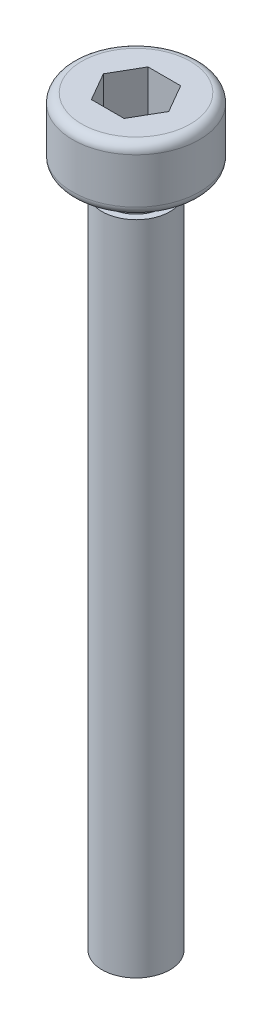
ISO-10303-21;
HEADER;
FILE_DESCRIPTION(('STEP AP214'),'2;1');
FILE_NAME('part.step','',(''),(''),'','','');
FILE_SCHEMA(('AUTOMOTIVE_DESIGN { 1 0 10303 214 1 1 1 1 }'));
ENDSEC;
DATA;
#1=APPLICATION_CONTEXT('core data for automotive mechanical design processes');
#2=APPLICATION_PROTOCOL_DEFINITION('international standard','automotive_design',2000,#1);
#3=PRODUCT_CONTEXT('',#1,'mechanical');
#4=PRODUCT('Part','Part','',(#3));
#5=PRODUCT_RELATED_PRODUCT_CATEGORY('part','',(#4));
#6=PRODUCT_DEFINITION_FORMATION('','',#4);
#7=PRODUCT_DEFINITION_CONTEXT('part definition',#1,'design');
#8=PRODUCT_DEFINITION('design','',#6,#7);
#9=PRODUCT_DEFINITION_SHAPE('','',#8);
#10=(LENGTH_UNIT() NAMED_UNIT(*) SI_UNIT(.MILLI.,.METRE.));
#11=(NAMED_UNIT(*) PLANE_ANGLE_UNIT() SI_UNIT($,.RADIAN.));
#12=(NAMED_UNIT(*) SI_UNIT($,.STERADIAN.) SOLID_ANGLE_UNIT());
#13=UNCERTAINTY_MEASURE_WITH_UNIT(LENGTH_MEASURE(1.E-05),#10,'distance_accuracy_value','');
#14=(GEOMETRIC_REPRESENTATION_CONTEXT(3) GLOBAL_UNCERTAINTY_ASSIGNED_CONTEXT((#13)) GLOBAL_UNIT_ASSIGNED_CONTEXT((#10,
#11,#12)) REPRESENTATION_CONTEXT('',''));
#15=CARTESIAN_POINT('',(0.,0.,0.));
#16=DIRECTION('',(0.,0.,1.));
#17=DIRECTION('',(1.,0.,0.));
#18=AXIS2_PLACEMENT_3D('',#15,#16,#17);
#19=CARTESIAN_POINT('',(0.,32.8,0.));
#20=DIRECTION('',(0.,-1.,0.));
#21=DIRECTION('',(0.,0.,-1.));
#22=AXIS2_PLACEMENT_3D('',#19,#20,#21);
#23=PLANE('',#22);
#24=DIRECTION('',(-0.5,0.,0.866025403784439));
#25=VECTOR('',#24,1.);
#26=CARTESIAN_POINT('',(-0.721687836487032,32.8,-1.25));
#27=LINE('',#26,#25);
#28=CARTESIAN_POINT('',(-0.721687836487032,32.8,-1.25));
#29=VERTEX_POINT('',#28);
#30=CARTESIAN_POINT('',(-1.44337567297406,32.8,0.));
#31=VERTEX_POINT('',#30);
#32=EDGE_CURVE('E124',#29,#31,#27,.T.);
#33=ORIENTED_EDGE('',*,*,#32,.F.);
#34=DIRECTION('',(-1.,0.,0.));
#35=VECTOR('',#34,1.);
#36=CARTESIAN_POINT('',(0.721687836487033,32.8,-1.25));
#37=LINE('',#36,#35);
#38=CARTESIAN_POINT('',(0.721687836487033,32.8,-1.25));
#39=VERTEX_POINT('',#38);
#40=EDGE_CURVE('E50',#39,#29,#37,.T.);
#41=ORIENTED_EDGE('',*,*,#40,.F.);
#42=DIRECTION('',(-0.5,0.,-0.866025403784439));
#43=VECTOR('',#42,1.);
#44=CARTESIAN_POINT('',(1.44337567297406,32.8,0.));
#45=LINE('',#44,#43);
#46=CARTESIAN_POINT('',(1.44337567297406,32.8,0.));
#47=VERTEX_POINT('',#46);
#48=EDGE_CURVE('E133',#47,#39,#45,.T.);
#49=ORIENTED_EDGE('',*,*,#48,.F.);
#50=DIRECTION('',(0.5,0.,-0.866025403784439));
#51=VECTOR('',#50,1.);
#52=CARTESIAN_POINT('',(0.721687836487032,32.8,1.25));
#53=LINE('',#52,#51);
#54=CARTESIAN_POINT('',(0.721687836487032,32.8,1.25));
#55=VERTEX_POINT('',#54);
#56=EDGE_CURVE('E131',#55,#47,#53,.T.);
#57=ORIENTED_EDGE('',*,*,#56,.F.);
#58=DIRECTION('',(1.,0.,0.));
#59=VECTOR('',#58,1.);
#60=CARTESIAN_POINT('',(-0.721687836487033,32.8,1.25));
#61=LINE('',#60,#59);
#62=CARTESIAN_POINT('',(-0.721687836487033,32.8,1.25));
#63=VERTEX_POINT('',#62);
#64=EDGE_CURVE('E98',#63,#55,#61,.T.);
#65=ORIENTED_EDGE('',*,*,#64,.F.);
#66=DIRECTION('',(0.5,0.,0.866025403784439));
#67=VECTOR('',#66,1.);
#68=CARTESIAN_POINT('',(-1.44337567297406,32.8,0.));
#69=LINE('',#68,#67);
#70=EDGE_CURVE('E127',#31,#63,#69,.T.);
#71=ORIENTED_EDGE('',*,*,#70,.F.);
#72=EDGE_LOOP('',(#33,#41,#49,#57,#65,#71));
#73=FACE_BOUND('',#72,.T.);
#74=CARTESIAN_POINT('',(0.,32.8,0.));
#75=DIRECTION('',(0.,-1.,0.));
#76=DIRECTION('',(0.,0.,-1.));
#77=AXIS2_PLACEMENT_3D('',#74,#75,#76);
#78=CIRCLE('',#77,2.4);
#79=CARTESIAN_POINT('',(0.,32.8,-2.4));
#80=VERTEX_POINT('',#79);
#81=EDGE_CURVE('E11',#80,#80,#78,.T.);
#82=ORIENTED_EDGE('',*,*,#81,.F.);
#83=EDGE_LOOP('',(#82));
#84=FACE_BOUND('',#83,.T.);
#85=ADVANCED_FACE('F36',(#73,#84),#23,.F.);
#86=CARTESIAN_POINT('',(0.,32.4,0.));
#87=DIRECTION('',(0.,-1.,0.));
#88=DIRECTION('',(0.,0.,-1.));
#89=AXIS2_PLACEMENT_3D('',#86,#87,#88);
#90=TOROIDAL_SURFACE('',#89,2.4,0.399999999999995);
#91=CARTESIAN_POINT('',(0.,32.4,0.));
#92=DIRECTION('',(0.,-1.,0.));
#93=DIRECTION('',(0.,0.,-1.));
#94=AXIS2_PLACEMENT_3D('',#91,#92,#93);
#95=CIRCLE('',#94,2.8);
#96=CARTESIAN_POINT('',(0.,32.4,-2.8));
#97=VERTEX_POINT('',#96);
#98=EDGE_CURVE('E43',#97,#97,#95,.T.);
#99=ORIENTED_EDGE('',*,*,#98,.F.);
#100=EDGE_LOOP('',(#99));
#101=FACE_BOUND('',#100,.T.);
#102=ORIENTED_EDGE('',*,*,#81,.T.);
#103=EDGE_LOOP('',(#102));
#104=FACE_BOUND('',#103,.T.);
#105=ADVANCED_FACE('F164',(#101,#104),#90,.T.);
#106=CARTESIAN_POINT('',(0.,0.,0.));
#107=DIRECTION('',(0.,-1.,0.));
#108=DIRECTION('',(0.,0.,-1.));
#109=AXIS2_PLACEMENT_3D('',#106,#107,#108);
#110=CYLINDRICAL_SURFACE('',#109,2.8);
#111=CARTESIAN_POINT('',(0.,30.4,0.));
#112=DIRECTION('',(0.,-1.,0.));
#113=DIRECTION('',(0.,0.,-1.));
#114=AXIS2_PLACEMENT_3D('',#111,#112,#113);
#115=CIRCLE('',#114,2.8);
#116=CARTESIAN_POINT('',(0.,30.4,-2.8));
#117=VERTEX_POINT('',#116);
#118=EDGE_CURVE('E157',#117,#117,#115,.T.);
#119=ORIENTED_EDGE('',*,*,#118,.F.);
#120=EDGE_LOOP('',(#119));
#121=FACE_BOUND('',#120,.T.);
#122=ORIENTED_EDGE('',*,*,#98,.T.);
#123=EDGE_LOOP('',(#122));
#124=FACE_BOUND('',#123,.T.);
#125=ADVANCED_FACE('F162',(#121,#124),#110,.T.);
#126=CARTESIAN_POINT('',(0.,30.4,0.));
#127=DIRECTION('',(0.,-1.,0.));
#128=DIRECTION('',(0.,0.,-1.));
#129=AXIS2_PLACEMENT_3D('',#126,#127,#128);
#130=TOROIDAL_SURFACE('',#129,2.4,0.4);
#131=CARTESIAN_POINT('',(0.,30.,0.));
#132=DIRECTION('',(0.,-1.,0.));
#133=DIRECTION('',(0.,0.,-1.));
#134=AXIS2_PLACEMENT_3D('',#131,#132,#133);
#135=CIRCLE('',#134,2.4);
#136=CARTESIAN_POINT('',(0.,30.,-2.4));
#137=VERTEX_POINT('',#136);
#138=EDGE_CURVE('E154',#137,#137,#135,.T.);
#139=ORIENTED_EDGE('',*,*,#138,.F.);
#140=EDGE_LOOP('',(#139));
#141=FACE_BOUND('',#140,.T.);
#142=ORIENTED_EDGE('',*,*,#118,.T.);
#143=EDGE_LOOP('',(#142));
#144=FACE_BOUND('',#143,.T.);
#145=ADVANCED_FACE('F209',(#141,#144),#130,.T.);
#146=CARTESIAN_POINT('',(-2.4,30.,0.));
#147=DIRECTION('',(0.,1.,0.));
#148=DIRECTION('',(0.,0.,1.));
#149=AXIS2_PLACEMENT_3D('',#146,#147,#148);
#150=PLANE('',#149);
#151=CARTESIAN_POINT('',(0.,30.,0.));
#152=DIRECTION('',(0.,-1.,0.));
#153=DIRECTION('',(0.,0.,-1.));
#154=AXIS2_PLACEMENT_3D('',#151,#152,#153);
#155=CIRCLE('',#154,1.20000000000001);
#156=CARTESIAN_POINT('',(0.,30.,-1.20000000000001));
#157=VERTEX_POINT('',#156);
#158=EDGE_CURVE('E151',#157,#157,#155,.T.);
#159=ORIENTED_EDGE('',*,*,#158,.F.);
#160=EDGE_LOOP('',(#159));
#161=FACE_BOUND('',#160,.T.);
#162=ORIENTED_EDGE('',*,*,#138,.T.);
#163=EDGE_LOOP('',(#162));
#164=FACE_BOUND('',#163,.T.);
#165=ADVANCED_FACE('F205',(#161,#164),#150,.F.);
#166=CARTESIAN_POINT('',(0.,0.,0.));
#167=DIRECTION('',(0.,-1.,0.));
#168=DIRECTION('',(0.,0.,-1.));
#169=AXIS2_PLACEMENT_3D('',#166,#167,#168);
#170=CYLINDRICAL_SURFACE('',#169,1.20000000000001);
#171=CARTESIAN_POINT('',(0.,29.,0.));
#172=DIRECTION('',(0.,-1.,0.));
#173=DIRECTION('',(0.,0.,-1.));
#174=AXIS2_PLACEMENT_3D('',#171,#172,#173);
#175=CIRCLE('',#174,1.20000000000001);
#176=CARTESIAN_POINT('',(0.,29.,-1.20000000000001));
#177=VERTEX_POINT('',#176);
#178=EDGE_CURVE('E148',#177,#177,#175,.T.);
#179=ORIENTED_EDGE('',*,*,#178,.F.);
#180=EDGE_LOOP('',(#179));
#181=FACE_BOUND('',#180,.T.);
#182=ORIENTED_EDGE('',*,*,#158,.T.);
#183=EDGE_LOOP('',(#182));
#184=FACE_BOUND('',#183,.T.);
#185=ADVANCED_FACE('F201',(#181,#184),#170,.T.);
#186=CARTESIAN_POINT('',(-1.20000000000001,29.,0.));
#187=DIRECTION('',(0.,-1.,0.));
#188=DIRECTION('',(0.,0.,-1.));
#189=AXIS2_PLACEMENT_3D('',#186,#187,#188);
#190=PLANE('',#189);
#191=CARTESIAN_POINT('',(0.,29.,0.));
#192=DIRECTION('',(0.,-1.,0.));
#193=DIRECTION('',(0.,0.,-1.));
#194=AXIS2_PLACEMENT_3D('',#191,#192,#193);
#195=CIRCLE('',#194,1.5);
#196=CARTESIAN_POINT('',(0.,29.,-1.5));
#197=VERTEX_POINT('',#196);
#198=EDGE_CURVE('E145',#197,#197,#195,.T.);
#199=ORIENTED_EDGE('',*,*,#198,.F.);
#200=EDGE_LOOP('',(#199));
#201=FACE_BOUND('',#200,.T.);
#202=ORIENTED_EDGE('',*,*,#178,.T.);
#203=EDGE_LOOP('',(#202));
#204=FACE_BOUND('',#203,.T.);
#205=ADVANCED_FACE('F197',(#201,#204),#190,.F.);
#206=CARTESIAN_POINT('',(0.,0.,0.));
#207=DIRECTION('',(0.,-1.,0.));
#208=DIRECTION('',(0.,0.,-1.));
#209=AXIS2_PLACEMENT_3D('',#206,#207,#208);
#210=CYLINDRICAL_SURFACE('',#209,1.5);
#211=CARTESIAN_POINT('',(0.,0.,0.));
#212=DIRECTION('',(0.,-1.,0.));
#213=DIRECTION('',(0.,0.,-1.));
#214=AXIS2_PLACEMENT_3D('',#211,#212,#213);
#215=CIRCLE('',#214,1.5);
#216=CARTESIAN_POINT('',(0.,0.,-1.5));
#217=VERTEX_POINT('',#216);
#218=EDGE_CURVE('E137',#217,#217,#215,.T.);
#219=ORIENTED_EDGE('',*,*,#218,.F.);
#220=EDGE_LOOP('',(#219));
#221=FACE_BOUND('',#220,.T.);
#222=ORIENTED_EDGE('',*,*,#198,.T.);
#223=EDGE_LOOP('',(#222));
#224=FACE_BOUND('',#223,.T.);
#225=ADVANCED_FACE('F189',(#221,#224),#210,.T.);
#226=CARTESIAN_POINT('',(-1.5,0.,0.));
#227=DIRECTION('',(0.,1.,0.));
#228=DIRECTION('',(0.,0.,1.));
#229=AXIS2_PLACEMENT_3D('',#226,#227,#228);
#230=PLANE('',#229);
#231=ORIENTED_EDGE('',*,*,#218,.T.);
#232=EDGE_LOOP('',(#231));
#233=FACE_BOUND('',#232,.T.);
#234=ADVANCED_FACE('F182',(#233),#230,.F.);
#235=CARTESIAN_POINT('',(0.721687836487033,30.8,-1.25));
#236=DIRECTION('',(0.,0.,-1.));
#237=DIRECTION('',(-1.,0.,0.));
#238=AXIS2_PLACEMENT_3D('',#235,#236,#237);
#239=PLANE('',#238);
#240=ORIENTED_EDGE('',*,*,#40,.T.);
#241=DIRECTION('',(0.,1.,0.));
#242=VECTOR('',#241,1.);
#243=CARTESIAN_POINT('',(-0.721687836487032,30.8,-1.25));
#244=LINE('',#243,#242);
#245=CARTESIAN_POINT('',(-0.721687836487032,30.8,-1.25));
#246=VERTEX_POINT('',#245);
#247=EDGE_CURVE('E80',#246,#29,#244,.T.);
#248=ORIENTED_EDGE('',*,*,#247,.F.);
#249=DIRECTION('',(-1.,0.,0.));
#250=VECTOR('',#249,1.);
#251=CARTESIAN_POINT('',(0.721687836487033,30.8,-1.25));
#252=LINE('',#251,#250);
#253=CARTESIAN_POINT('',(0.721687836487033,30.8,-1.25));
#254=VERTEX_POINT('',#253);
#255=EDGE_CURVE('E135',#254,#246,#252,.T.);
#256=ORIENTED_EDGE('',*,*,#255,.F.);
#257=DIRECTION('',(0.,1.,0.));
#258=VECTOR('',#257,1.);
#259=CARTESIAN_POINT('',(0.721687836487033,30.8,-1.25));
#260=LINE('',#259,#258);
#261=EDGE_CURVE('E58',#254,#39,#260,.T.);
#262=ORIENTED_EDGE('',*,*,#261,.T.);
#263=EDGE_LOOP('',(#240,#248,#256,#262));
#264=FACE_BOUND('',#263,.T.);
#265=ADVANCED_FACE('F179',(#264),#239,.F.);
#266=CARTESIAN_POINT('',(1.44337567297406,30.8,0.));
#267=DIRECTION('',(0.866025403784439,0.,-0.5));
#268=DIRECTION('',(-0.5,0.,-0.866025403784439));
#269=AXIS2_PLACEMENT_3D('',#266,#267,#268);
#270=PLANE('',#269);
#271=ORIENTED_EDGE('',*,*,#48,.T.);
#272=ORIENTED_EDGE('',*,*,#261,.F.);
#273=DIRECTION('',(-0.5,0.,-0.866025403784439));
#274=VECTOR('',#273,1.);
#275=CARTESIAN_POINT('',(1.44337567297406,30.8,0.));
#276=LINE('',#275,#274);
#277=CARTESIAN_POINT('',(1.44337567297406,30.8,0.));
#278=VERTEX_POINT('',#277);
#279=EDGE_CURVE('E110',#278,#254,#276,.T.);
#280=ORIENTED_EDGE('',*,*,#279,.F.);
#281=DIRECTION('',(0.,1.,0.));
#282=VECTOR('',#281,1.);
#283=CARTESIAN_POINT('',(1.44337567297406,30.8,0.));
#284=LINE('',#283,#282);
#285=EDGE_CURVE('E102',#278,#47,#284,.T.);
#286=ORIENTED_EDGE('',*,*,#285,.T.);
#287=EDGE_LOOP('',(#271,#272,#280,#286));
#288=FACE_BOUND('',#287,.T.);
#289=ADVANCED_FACE('F181',(#288),#270,.F.);
#290=CARTESIAN_POINT('',(0.721687836487032,30.8,1.25));
#291=DIRECTION('',(0.866025403784439,0.,0.5));
#292=DIRECTION('',(0.5,0.,-0.866025403784439));
#293=AXIS2_PLACEMENT_3D('',#290,#291,#292);
#294=PLANE('',#293);
#295=ORIENTED_EDGE('',*,*,#56,.T.);
#296=ORIENTED_EDGE('',*,*,#285,.F.);
#297=DIRECTION('',(0.5,0.,-0.866025403784439));
#298=VECTOR('',#297,1.);
#299=CARTESIAN_POINT('',(0.721687836487032,30.8,1.25));
#300=LINE('',#299,#298);
#301=CARTESIAN_POINT('',(0.721687836487032,30.8,1.25));
#302=VERTEX_POINT('',#301);
#303=EDGE_CURVE('E106',#302,#278,#300,.T.);
#304=ORIENTED_EDGE('',*,*,#303,.F.);
#305=DIRECTION('',(0.,1.,0.));
#306=VECTOR('',#305,1.);
#307=CARTESIAN_POINT('',(0.721687836487032,30.8,1.25));
#308=LINE('',#307,#306);
#309=EDGE_CURVE('E91',#302,#55,#308,.T.);
#310=ORIENTED_EDGE('',*,*,#309,.T.);
#311=EDGE_LOOP('',(#295,#296,#304,#310));
#312=FACE_BOUND('',#311,.T.);
#313=ADVANCED_FACE('F107',(#312),#294,.F.);
#314=CARTESIAN_POINT('',(-0.721687836487033,30.8,1.25));
#315=DIRECTION('',(0.,0.,1.));
#316=DIRECTION('',(1.,0.,0.));
#317=AXIS2_PLACEMENT_3D('',#314,#315,#316);
#318=PLANE('',#317);
#319=ORIENTED_EDGE('',*,*,#64,.T.);
#320=ORIENTED_EDGE('',*,*,#309,.F.);
#321=DIRECTION('',(1.,0.,0.));
#322=VECTOR('',#321,1.);
#323=CARTESIAN_POINT('',(-0.721687836487033,30.8,1.25));
#324=LINE('',#323,#322);
#325=CARTESIAN_POINT('',(-0.721687836487033,30.8,1.25));
#326=VERTEX_POINT('',#325);
#327=EDGE_CURVE('E95',#326,#302,#324,.T.);
#328=ORIENTED_EDGE('',*,*,#327,.F.);
#329=DIRECTION('',(0.,1.,0.));
#330=VECTOR('',#329,1.);
#331=CARTESIAN_POINT('',(-0.721687836487033,30.8,1.25));
#332=LINE('',#331,#330);
#333=EDGE_CURVE('E103',#326,#63,#332,.T.);
#334=ORIENTED_EDGE('',*,*,#333,.T.);
#335=EDGE_LOOP('',(#319,#320,#328,#334));
#336=FACE_BOUND('',#335,.T.);
#337=ADVANCED_FACE('F93',(#336),#318,.F.);
#338=CARTESIAN_POINT('',(-1.44337567297406,30.8,0.));
#339=DIRECTION('',(-0.866025403784439,0.,0.5));
#340=DIRECTION('',(0.5,0.,0.866025403784439));
#341=AXIS2_PLACEMENT_3D('',#338,#339,#340);
#342=PLANE('',#341);
#343=ORIENTED_EDGE('',*,*,#70,.T.);
#344=ORIENTED_EDGE('',*,*,#333,.F.);
#345=DIRECTION('',(0.5,0.,0.866025403784439));
#346=VECTOR('',#345,1.);
#347=CARTESIAN_POINT('',(-1.44337567297406,30.8,0.));
#348=LINE('',#347,#346);
#349=CARTESIAN_POINT('',(-1.44337567297406,30.8,0.));
#350=VERTEX_POINT('',#349);
#351=EDGE_CURVE('E116',#350,#326,#348,.T.);
#352=ORIENTED_EDGE('',*,*,#351,.F.);
#353=DIRECTION('',(0.,1.,0.));
#354=VECTOR('',#353,1.);
#355=CARTESIAN_POINT('',(-1.44337567297406,30.8,0.));
#356=LINE('',#355,#354);
#357=EDGE_CURVE('E140',#350,#31,#356,.T.);
#358=ORIENTED_EDGE('',*,*,#357,.T.);
#359=EDGE_LOOP('',(#343,#344,#352,#358));
#360=FACE_BOUND('',#359,.T.);
#361=ADVANCED_FACE('F280',(#360),#342,.F.);
#362=CARTESIAN_POINT('',(-0.721687836487032,30.8,-1.25));
#363=DIRECTION('',(-0.866025403784439,0.,-0.5));
#364=DIRECTION('',(-0.5,0.,0.866025403784439));
#365=AXIS2_PLACEMENT_3D('',#362,#363,#364);
#366=PLANE('',#365);
#367=ORIENTED_EDGE('',*,*,#32,.T.);
#368=ORIENTED_EDGE('',*,*,#357,.F.);
#369=DIRECTION('',(-0.5,0.,0.866025403784439));
#370=VECTOR('',#369,1.);
#371=CARTESIAN_POINT('',(-0.721687836487032,30.8,-1.25));
#372=LINE('',#371,#370);
#373=EDGE_CURVE('E118',#246,#350,#372,.T.);
#374=ORIENTED_EDGE('',*,*,#373,.F.);
#375=ORIENTED_EDGE('',*,*,#247,.T.);
#376=EDGE_LOOP('',(#367,#368,#374,#375));
#377=FACE_BOUND('',#376,.T.);
#378=ADVANCED_FACE('F177',(#377),#366,.F.);
#379=CARTESIAN_POINT('',(0.,30.8,0.));
#380=DIRECTION('',(0.,1.,0.));
#381=DIRECTION('',(0.,0.,1.));
#382=AXIS2_PLACEMENT_3D('',#379,#380,#381);
#383=PLANE('',#382);
#384=ORIENTED_EDGE('',*,*,#255,.T.);
#385=ORIENTED_EDGE('',*,*,#373,.T.);
#386=ORIENTED_EDGE('',*,*,#351,.T.);
#387=ORIENTED_EDGE('',*,*,#327,.T.);
#388=ORIENTED_EDGE('',*,*,#303,.T.);
#389=ORIENTED_EDGE('',*,*,#279,.T.);
#390=EDGE_LOOP('',(#384,#385,#386,#387,#388,#389));
#391=FACE_BOUND('',#390,.T.);
#392=ADVANCED_FACE('F113',(#391),#383,.T.);
#393=CLOSED_SHELL('',(#85,#105,#125,#145,#165,#185,#205,#225,#234,#265,#289,#313,#337,#361,#378,#392));
#394=MANIFOLD_SOLID_BREP('B2',#393);
#395=ADVANCED_BREP_SHAPE_REPRESENTATION('',(#18,#394),#14);
#396=SHAPE_DEFINITION_REPRESENTATION(#9,#395);
ENDSEC;
END-ISO-10303-21;
